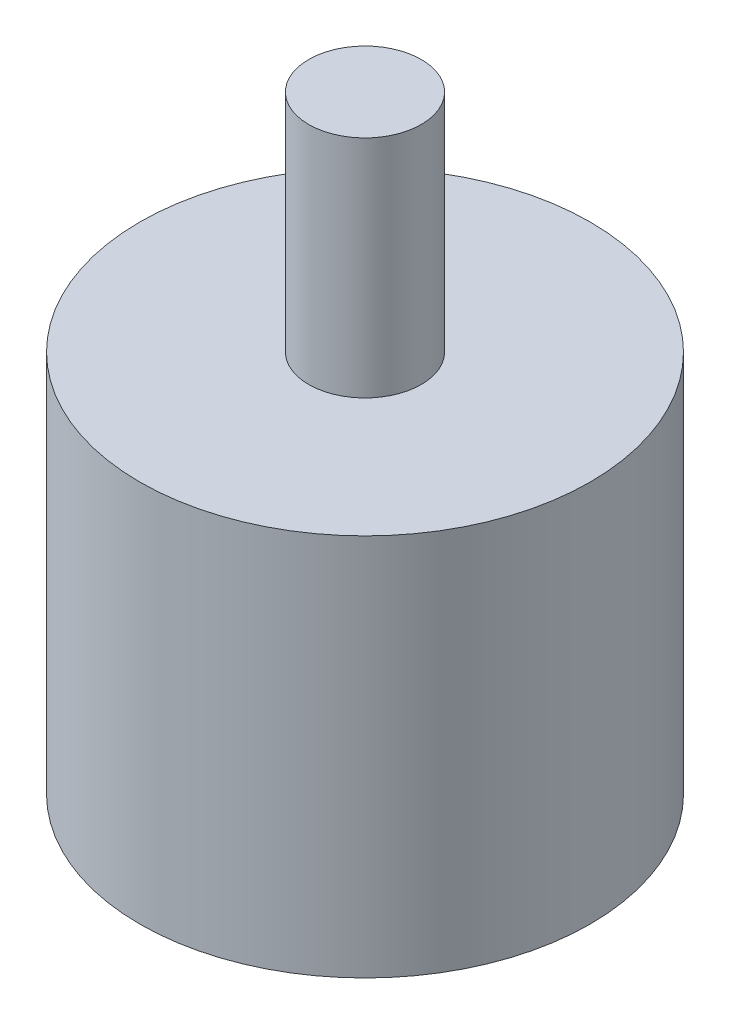
ISO-10303-21;
HEADER;
FILE_DESCRIPTION(('STEP AP214'),'2;1');
FILE_NAME('part.step','',(''),(''),'','','');
FILE_SCHEMA(('AUTOMOTIVE_DESIGN { 1 0 10303 214 1 1 1 1 }'));
ENDSEC;
DATA;
#1=APPLICATION_CONTEXT('core data for automotive mechanical design processes');
#2=APPLICATION_PROTOCOL_DEFINITION('international standard','automotive_design',2000,#1);
#3=PRODUCT_CONTEXT('',#1,'mechanical');
#4=PRODUCT('Part','Part','',(#3));
#5=PRODUCT_RELATED_PRODUCT_CATEGORY('part','',(#4));
#6=PRODUCT_DEFINITION_FORMATION('','',#4);
#7=PRODUCT_DEFINITION_CONTEXT('part definition',#1,'design');
#8=PRODUCT_DEFINITION('design','',#6,#7);
#9=PRODUCT_DEFINITION_SHAPE('','',#8);
#10=(LENGTH_UNIT() NAMED_UNIT(*) SI_UNIT(.MILLI.,.METRE.));
#11=(NAMED_UNIT(*) PLANE_ANGLE_UNIT() SI_UNIT($,.RADIAN.));
#12=(NAMED_UNIT(*) SI_UNIT($,.STERADIAN.) SOLID_ANGLE_UNIT());
#13=UNCERTAINTY_MEASURE_WITH_UNIT(LENGTH_MEASURE(1.E-05),#10,'distance_accuracy_value','');
#14=(GEOMETRIC_REPRESENTATION_CONTEXT(3) GLOBAL_UNCERTAINTY_ASSIGNED_CONTEXT((#13)) GLOBAL_UNIT_ASSIGNED_CONTEXT((#10,
#11,#12)) REPRESENTATION_CONTEXT('',''));
#15=CARTESIAN_POINT('',(0.,0.,0.));
#16=DIRECTION('',(0.,0.,1.));
#17=DIRECTION('',(1.,0.,0.));
#18=AXIS2_PLACEMENT_3D('',#15,#16,#17);
#19=CARTESIAN_POINT('',(0.,227.5,187.5));
#20=DIRECTION('',(0.,-1.,0.));
#21=DIRECTION('',(0.,0.,-1.));
#22=AXIS2_PLACEMENT_3D('',#19,#20,#21);
#23=PLANE('',#22);
#24=CARTESIAN_POINT('',(0.,227.5,190.));
#25=DIRECTION('',(0.,1.,0.));
#26=DIRECTION('',(0.,0.,1.));
#27=AXIS2_PLACEMENT_3D('',#24,#25,#26);
#28=CIRCLE('',#27,2.50000000000003);
#29=CARTESIAN_POINT('',(0.,227.5,192.5));
#30=VERTEX_POINT('',#29);
#31=EDGE_CURVE('E59',#30,#30,#28,.T.);
#32=ORIENTED_EDGE('',*,*,#31,.T.);
#33=EDGE_LOOP('',(#32));
#34=FACE_BOUND('',#33,.T.);
#35=ADVANCED_FACE('F37',(#34),#23,.F.);
#36=CARTESIAN_POINT('',(0.,208.5,190.));
#37=DIRECTION('',(0.,1.,0.));
#38=DIRECTION('',(0.,0.,1.));
#39=AXIS2_PLACEMENT_3D('',#36,#37,#38);
#40=PLANE('',#39);
#41=CARTESIAN_POINT('',(0.,208.5,190.));
#42=DIRECTION('',(0.,1.,0.));
#43=DIRECTION('',(0.,0.,1.));
#44=AXIS2_PLACEMENT_3D('',#41,#42,#43);
#45=CIRCLE('',#44,3.);
#46=CARTESIAN_POINT('',(0.,208.5,193.));
#47=VERTEX_POINT('',#46);
#48=EDGE_CURVE('E10',#47,#47,#45,.T.);
#49=ORIENTED_EDGE('',*,*,#48,.F.);
#50=EDGE_LOOP('',(#49));
#51=FACE_BOUND('',#50,.T.);
#52=ADVANCED_FACE('F89',(#51),#40,.F.);
#53=CARTESIAN_POINT('',(0.,227.5,190.));
#54=DIRECTION('',(0.,1.,0.));
#55=DIRECTION('',(0.,0.,1.));
#56=AXIS2_PLACEMENT_3D('',#53,#54,#55);
#57=CYLINDRICAL_SURFACE('',#56,3.);
#58=CARTESIAN_POINT('',(0.,200.5,190.));
#59=DIRECTION('',(0.,1.,0.));
#60=DIRECTION('',(0.,0.,1.));
#61=AXIS2_PLACEMENT_3D('',#58,#59,#60);
#62=CIRCLE('',#61,3.);
#63=CARTESIAN_POINT('',(0.,200.5,193.));
#64=VERTEX_POINT('',#63);
#65=EDGE_CURVE('E43',#64,#64,#62,.T.);
#66=ORIENTED_EDGE('',*,*,#65,.F.);
#67=EDGE_LOOP('',(#66));
#68=FACE_BOUND('',#67,.T.);
#69=ORIENTED_EDGE('',*,*,#48,.T.);
#70=EDGE_LOOP('',(#69));
#71=FACE_BOUND('',#70,.T.);
#72=ADVANCED_FACE('F84',(#68,#71),#57,.F.);
#73=CARTESIAN_POINT('',(0.,200.5,187.));
#74=DIRECTION('',(0.,1.,0.));
#75=DIRECTION('',(0.,0.,1.));
#76=AXIS2_PLACEMENT_3D('',#73,#74,#75);
#77=PLANE('',#76);
#78=CARTESIAN_POINT('',(0.,200.5,190.));
#79=DIRECTION('',(0.,1.,0.));
#80=DIRECTION('',(0.,0.,1.));
#81=AXIS2_PLACEMENT_3D('',#78,#79,#80);
#82=CIRCLE('',#81,10.);
#83=CARTESIAN_POINT('',(0.,200.5,200.));
#84=VERTEX_POINT('',#83);
#85=EDGE_CURVE('E47',#84,#84,#82,.T.);
#86=ORIENTED_EDGE('',*,*,#85,.F.);
#87=EDGE_LOOP('',(#86));
#88=FACE_BOUND('',#87,.T.);
#89=ORIENTED_EDGE('',*,*,#65,.T.);
#90=EDGE_LOOP('',(#89));
#91=FACE_BOUND('',#90,.T.);
#92=ADVANCED_FACE('F79',(#88,#91),#77,.F.);
#93=CARTESIAN_POINT('',(0.,227.5,190.));
#94=DIRECTION('',(0.,1.,0.));
#95=DIRECTION('',(0.,0.,1.));
#96=AXIS2_PLACEMENT_3D('',#93,#94,#95);
#97=CYLINDRICAL_SURFACE('',#96,10.);
#98=CARTESIAN_POINT('',(0.,217.5,190.));
#99=DIRECTION('',(0.,1.,0.));
#100=DIRECTION('',(0.,0.,1.));
#101=AXIS2_PLACEMENT_3D('',#98,#99,#100);
#102=CIRCLE('',#101,10.);
#103=CARTESIAN_POINT('',(0.,217.5,200.));
#104=VERTEX_POINT('',#103);
#105=EDGE_CURVE('E51',#104,#104,#102,.T.);
#106=ORIENTED_EDGE('',*,*,#105,.F.);
#107=EDGE_LOOP('',(#106));
#108=FACE_BOUND('',#107,.T.);
#109=ORIENTED_EDGE('',*,*,#85,.T.);
#110=EDGE_LOOP('',(#109));
#111=FACE_BOUND('',#110,.T.);
#112=ADVANCED_FACE('F73',(#108,#111),#97,.T.);
#113=CARTESIAN_POINT('',(0.,217.5,180.));
#114=DIRECTION('',(0.,-1.,0.));
#115=DIRECTION('',(0.,0.,-1.));
#116=AXIS2_PLACEMENT_3D('',#113,#114,#115);
#117=PLANE('',#116);
#118=CARTESIAN_POINT('',(0.,217.5,190.));
#119=DIRECTION('',(0.,1.,0.));
#120=DIRECTION('',(0.,0.,1.));
#121=AXIS2_PLACEMENT_3D('',#118,#119,#120);
#122=CIRCLE('',#121,2.5);
#123=CARTESIAN_POINT('',(0.,217.5,192.5));
#124=VERTEX_POINT('',#123);
#125=EDGE_CURVE('E56',#124,#124,#122,.T.);
#126=ORIENTED_EDGE('',*,*,#125,.F.);
#127=EDGE_LOOP('',(#126));
#128=FACE_BOUND('',#127,.T.);
#129=ORIENTED_EDGE('',*,*,#105,.T.);
#130=EDGE_LOOP('',(#129));
#131=FACE_BOUND('',#130,.T.);
#132=ADVANCED_FACE('F67',(#128,#131),#117,.F.);
#133=CARTESIAN_POINT('',(0.,227.5,190.));
#134=DIRECTION('',(0.,1.,0.));
#135=DIRECTION('',(0.,0.,1.));
#136=AXIS2_PLACEMENT_3D('',#133,#134,#135);
#137=CYLINDRICAL_SURFACE('',#136,2.50000000000002);
#138=ORIENTED_EDGE('',*,*,#31,.F.);
#139=EDGE_LOOP('',(#138));
#140=FACE_BOUND('',#139,.T.);
#141=ORIENTED_EDGE('',*,*,#125,.T.);
#142=EDGE_LOOP('',(#141));
#143=FACE_BOUND('',#142,.T.);
#144=ADVANCED_FACE('F64',(#140,#143),#137,.T.);
#145=CLOSED_SHELL('',(#35,#52,#72,#92,#112,#132,#144));
#146=MANIFOLD_SOLID_BREP('B2',#145);
#147=ADVANCED_BREP_SHAPE_REPRESENTATION('',(#18,#146),#14);
#148=SHAPE_DEFINITION_REPRESENTATION(#9,#147);
ENDSEC;
END-ISO-10303-21;
